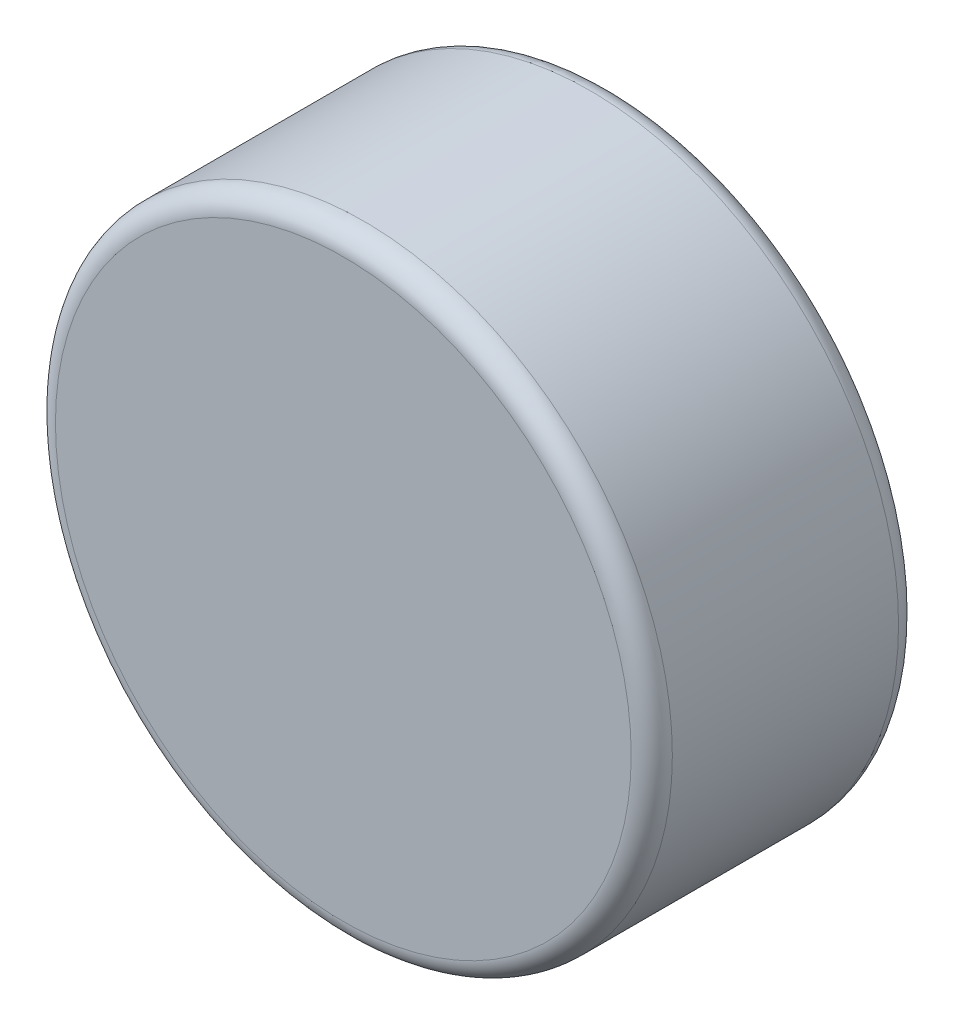
ISO-10303-21;
HEADER;
FILE_DESCRIPTION(('STEP AP214'),'2;1');
FILE_NAME('part.step','',(''),(''),'','','');
FILE_SCHEMA(('AUTOMOTIVE_DESIGN { 1 0 10303 214 1 1 1 1 }'));
ENDSEC;
DATA;
#1=APPLICATION_CONTEXT('core data for automotive mechanical design processes');
#2=APPLICATION_PROTOCOL_DEFINITION('international standard','automotive_design',2000,#1);
#3=PRODUCT_CONTEXT('',#1,'mechanical');
#4=PRODUCT('Part','Part','',(#3));
#5=PRODUCT_RELATED_PRODUCT_CATEGORY('part','',(#4));
#6=PRODUCT_DEFINITION_FORMATION('','',#4);
#7=PRODUCT_DEFINITION_CONTEXT('part definition',#1,'design');
#8=PRODUCT_DEFINITION('design','',#6,#7);
#9=PRODUCT_DEFINITION_SHAPE('','',#8);
#10=(LENGTH_UNIT() NAMED_UNIT(*) SI_UNIT(.MILLI.,.METRE.));
#11=(NAMED_UNIT(*) PLANE_ANGLE_UNIT() SI_UNIT($,.RADIAN.));
#12=(NAMED_UNIT(*) SI_UNIT($,.STERADIAN.) SOLID_ANGLE_UNIT());
#13=UNCERTAINTY_MEASURE_WITH_UNIT(LENGTH_MEASURE(1.E-05),#10,'distance_accuracy_value','');
#14=(GEOMETRIC_REPRESENTATION_CONTEXT(3) GLOBAL_UNCERTAINTY_ASSIGNED_CONTEXT((#13)) GLOBAL_UNIT_ASSIGNED_CONTEXT((#10,
#11,#12)) REPRESENTATION_CONTEXT('',''));
#15=CARTESIAN_POINT('',(0.,0.,0.));
#16=DIRECTION('',(0.,0.,1.));
#17=DIRECTION('',(1.,0.,0.));
#18=AXIS2_PLACEMENT_3D('',#15,#16,#17);
#19=CARTESIAN_POINT('',(0.,0.,2.6));
#20=DIRECTION('',(0.,0.,-1.));
#21=DIRECTION('',(-1.,0.,0.));
#22=AXIS2_PLACEMENT_3D('',#19,#20,#21);
#23=CYLINDRICAL_SURFACE('',#22,3.);
#24=CARTESIAN_POINT('',(0.,0.,0.2));
#25=DIRECTION('',(0.,0.,1.));
#26=DIRECTION('',(1.,0.,0.));
#27=AXIS2_PLACEMENT_3D('',#24,#25,#26);
#28=CIRCLE('',#27,3.);
#29=CARTESIAN_POINT('',(3.,0.,0.2));
#30=VERTEX_POINT('',#29);
#31=EDGE_CURVE('E42',#30,#30,#28,.T.);
#32=ORIENTED_EDGE('',*,*,#31,.T.);
#33=EDGE_LOOP('',(#32));
#34=FACE_BOUND('',#33,.T.);
#35=CARTESIAN_POINT('',(0.,0.,2.4));
#36=DIRECTION('',(0.,0.,1.));
#37=DIRECTION('',(1.,0.,0.));
#38=AXIS2_PLACEMENT_3D('',#35,#36,#37);
#39=CIRCLE('',#38,3.);
#40=CARTESIAN_POINT('',(3.,0.,2.4));
#41=VERTEX_POINT('',#40);
#42=EDGE_CURVE('E46',#41,#41,#39,.F.);
#43=ORIENTED_EDGE('',*,*,#42,.T.);
#44=EDGE_LOOP('',(#43));
#45=FACE_BOUND('',#44,.T.);
#46=ADVANCED_FACE('F31',(#34,#45),#23,.T.);
#47=CARTESIAN_POINT('',(0.,0.,2.6));
#48=DIRECTION('',(0.,0.,1.));
#49=DIRECTION('',(1.,0.,0.));
#50=AXIS2_PLACEMENT_3D('',#47,#48,#49);
#51=PLANE('',#50);
#52=CARTESIAN_POINT('',(0.,0.,2.6));
#53=DIRECTION('',(0.,0.,1.));
#54=DIRECTION('',(1.,0.,0.));
#55=AXIS2_PLACEMENT_3D('',#52,#53,#54);
#56=CIRCLE('',#55,2.8);
#57=CARTESIAN_POINT('',(2.8,0.,2.6));
#58=VERTEX_POINT('',#57);
#59=EDGE_CURVE('E10',#58,#58,#56,.T.);
#60=ORIENTED_EDGE('',*,*,#59,.T.);
#61=EDGE_LOOP('',(#60));
#62=FACE_BOUND('',#61,.T.);
#63=ADVANCED_FACE('F62',(#62),#51,.T.);
#64=CARTESIAN_POINT('',(0.,0.,0.));
#65=DIRECTION('',(0.,0.,1.));
#66=DIRECTION('',(1.,0.,0.));
#67=AXIS2_PLACEMENT_3D('',#64,#65,#66);
#68=PLANE('',#67);
#69=CARTESIAN_POINT('',(0.,0.,0.));
#70=DIRECTION('',(0.,0.,1.));
#71=DIRECTION('',(1.,0.,0.));
#72=AXIS2_PLACEMENT_3D('',#69,#70,#71);
#73=CIRCLE('',#72,2.8);
#74=CARTESIAN_POINT('',(2.8,0.,0.));
#75=VERTEX_POINT('',#74);
#76=EDGE_CURVE('E38',#75,#75,#73,.F.);
#77=ORIENTED_EDGE('',*,*,#76,.T.);
#78=EDGE_LOOP('',(#77));
#79=FACE_BOUND('',#78,.T.);
#80=ADVANCED_FACE('F59',(#79),#68,.F.);
#81=CARTESIAN_POINT('',(0.,0.,0.2));
#82=DIRECTION('',(0.,0.,1.));
#83=DIRECTION('',(1.,0.,0.));
#84=AXIS2_PLACEMENT_3D('',#81,#82,#83);
#85=TOROIDAL_SURFACE('',#84,2.8,0.2);
#86=ORIENTED_EDGE('',*,*,#76,.F.);
#87=EDGE_LOOP('',(#86));
#88=FACE_BOUND('',#87,.T.);
#89=ORIENTED_EDGE('',*,*,#31,.F.);
#90=EDGE_LOOP('',(#89));
#91=FACE_BOUND('',#90,.T.);
#92=ADVANCED_FACE('F55',(#88,#91),#85,.T.);
#93=CARTESIAN_POINT('',(0.,0.,2.4));
#94=DIRECTION('',(0.,0.,1.));
#95=DIRECTION('',(1.,0.,0.));
#96=AXIS2_PLACEMENT_3D('',#93,#94,#95);
#97=TOROIDAL_SURFACE('',#96,2.8,0.2);
#98=ORIENTED_EDGE('',*,*,#42,.F.);
#99=EDGE_LOOP('',(#98));
#100=FACE_BOUND('',#99,.T.);
#101=ORIENTED_EDGE('',*,*,#59,.F.);
#102=EDGE_LOOP('',(#101));
#103=FACE_BOUND('',#102,.T.);
#104=ADVANCED_FACE('F33',(#100,#103),#97,.T.);
#105=CLOSED_SHELL('',(#46,#63,#80,#92,#104));
#106=MANIFOLD_SOLID_BREP('B2',#105);
#107=ADVANCED_BREP_SHAPE_REPRESENTATION('',(#18,#106),#14);
#108=SHAPE_DEFINITION_REPRESENTATION(#9,#107);
ENDSEC;
END-ISO-10303-21;
